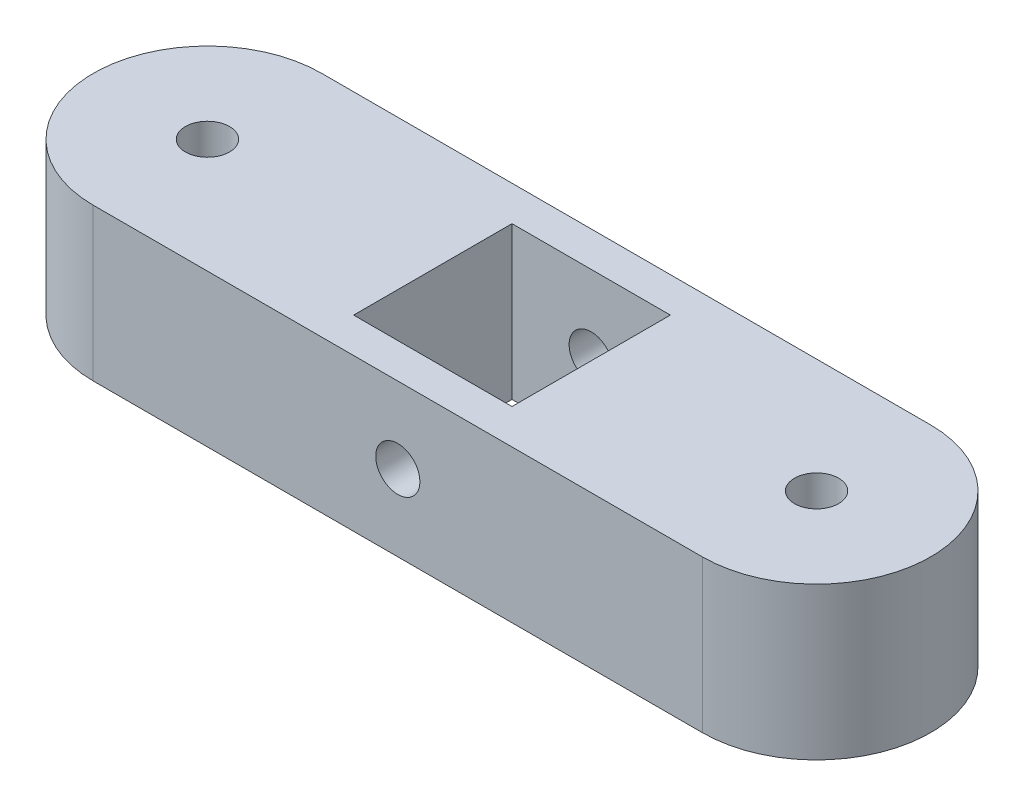
ISO-10303-21;
HEADER;
FILE_DESCRIPTION(('STEP AP214'),'2;1');
FILE_NAME('part.step','',(''),(''),'','','');
FILE_SCHEMA(('AUTOMOTIVE_DESIGN { 1 0 10303 214 1 1 1 1 }'));
ENDSEC;
DATA;
#1=APPLICATION_CONTEXT('core data for automotive mechanical design processes');
#2=APPLICATION_PROTOCOL_DEFINITION('international standard','automotive_design',2000,#1);
#3=PRODUCT_CONTEXT('',#1,'mechanical');
#4=PRODUCT('Part','Part','',(#3));
#5=PRODUCT_RELATED_PRODUCT_CATEGORY('part','',(#4));
#6=PRODUCT_DEFINITION_FORMATION('','',#4);
#7=PRODUCT_DEFINITION_CONTEXT('part definition',#1,'design');
#8=PRODUCT_DEFINITION('design','',#6,#7);
#9=PRODUCT_DEFINITION_SHAPE('','',#8);
#10=(LENGTH_UNIT() NAMED_UNIT(*) SI_UNIT(.MILLI.,.METRE.));
#11=(NAMED_UNIT(*) PLANE_ANGLE_UNIT() SI_UNIT($,.RADIAN.));
#12=(NAMED_UNIT(*) SI_UNIT($,.STERADIAN.) SOLID_ANGLE_UNIT());
#13=UNCERTAINTY_MEASURE_WITH_UNIT(LENGTH_MEASURE(1.E-05),#10,'distance_accuracy_value','');
#14=(GEOMETRIC_REPRESENTATION_CONTEXT(3) GLOBAL_UNCERTAINTY_ASSIGNED_CONTEXT((#13)) GLOBAL_UNIT_ASSIGNED_CONTEXT((#10,
#11,#12)) REPRESENTATION_CONTEXT('',''));
#15=CARTESIAN_POINT('',(0.,0.,0.));
#16=DIRECTION('',(0.,0.,1.));
#17=DIRECTION('',(1.,0.,0.));
#18=AXIS2_PLACEMENT_3D('',#15,#16,#17);
#19=CARTESIAN_POINT('',(-50.8,25.4,0.));
#20=DIRECTION('',(0.,1.,0.));
#21=DIRECTION('',(0.,0.,1.));
#22=AXIS2_PLACEMENT_3D('',#19,#20,#21);
#23=PLANE('',#22);
#24=DIRECTION('',(0.,0.,1.));
#25=VECTOR('',#24,1.);
#26=CARTESIAN_POINT('',(-13.208,25.4,-13.208));
#27=LINE('',#26,#25);
#28=CARTESIAN_POINT('',(-13.208,25.4,-13.208));
#29=VERTEX_POINT('',#28);
#30=CARTESIAN_POINT('',(-13.208,25.4,13.208));
#31=VERTEX_POINT('',#30);
#32=EDGE_CURVE('E107',#29,#31,#27,.T.);
#33=ORIENTED_EDGE('',*,*,#32,.F.);
#34=DIRECTION('',(-1.,0.,0.));
#35=VECTOR('',#34,1.);
#36=CARTESIAN_POINT('',(-13.208,25.4,-13.208));
#37=LINE('',#36,#35);
#38=CARTESIAN_POINT('',(13.208,25.4,-13.208));
#39=VERTEX_POINT('',#38);
#40=EDGE_CURVE('E99',#39,#29,#37,.T.);
#41=ORIENTED_EDGE('',*,*,#40,.F.);
#42=DIRECTION('',(0.,0.,-1.));
#43=VECTOR('',#42,1.);
#44=CARTESIAN_POINT('',(13.208,25.4,-13.208));
#45=LINE('',#44,#43);
#46=CARTESIAN_POINT('',(13.208,25.4,13.208));
#47=VERTEX_POINT('',#46);
#48=EDGE_CURVE('E122',#47,#39,#45,.T.);
#49=ORIENTED_EDGE('',*,*,#48,.F.);
#50=DIRECTION('',(1.,0.,0.));
#51=VECTOR('',#50,1.);
#52=CARTESIAN_POINT('',(-13.208,25.4,13.208));
#53=LINE('',#52,#51);
#54=EDGE_CURVE('E120',#31,#47,#53,.T.);
#55=ORIENTED_EDGE('',*,*,#54,.F.);
#56=EDGE_LOOP('',(#33,#41,#49,#55));
#57=FACE_BOUND('',#56,.T.);
#58=CARTESIAN_POINT('',(-50.8,25.4,0.));
#59=DIRECTION('',(0.,1.,0.));
#60=DIRECTION('',(0.,0.,1.));
#61=AXIS2_PLACEMENT_3D('',#58,#59,#60);
#62=CIRCLE('',#61,3.683);
#63=CARTESIAN_POINT('',(-50.8,25.4,3.683));
#64=VERTEX_POINT('',#63);
#65=EDGE_CURVE('E138',#64,#64,#62,.T.);
#66=ORIENTED_EDGE('',*,*,#65,.F.);
#67=EDGE_LOOP('',(#66));
#68=FACE_BOUND('',#67,.T.);
#69=CARTESIAN_POINT('',(-50.8,25.4,0.));
#70=DIRECTION('',(0.,1.,0.));
#71=DIRECTION('',(0.,0.,1.));
#72=AXIS2_PLACEMENT_3D('',#69,#70,#71);
#73=CIRCLE('',#72,19.05);
#74=CARTESIAN_POINT('',(-50.8,25.4,-19.05));
#75=VERTEX_POINT('',#74);
#76=CARTESIAN_POINT('',(-50.8,25.4,19.05));
#77=VERTEX_POINT('',#76);
#78=EDGE_CURVE('E144',#75,#77,#73,.T.);
#79=ORIENTED_EDGE('',*,*,#78,.T.);
#80=DIRECTION('',(1.,0.,0.));
#81=VECTOR('',#80,1.);
#82=CARTESIAN_POINT('',(-50.8,25.4,19.05));
#83=LINE('',#82,#81);
#84=CARTESIAN_POINT('',(50.8,25.4,19.05));
#85=VERTEX_POINT('',#84);
#86=EDGE_CURVE('E147',#77,#85,#83,.T.);
#87=ORIENTED_EDGE('',*,*,#86,.T.);
#88=CARTESIAN_POINT('',(50.8,25.4,0.));
#89=DIRECTION('',(0.,1.,0.));
#90=DIRECTION('',(0.,0.,1.));
#91=AXIS2_PLACEMENT_3D('',#88,#89,#90);
#92=CIRCLE('',#91,19.05);
#93=CARTESIAN_POINT('',(50.8,25.4,-19.05));
#94=VERTEX_POINT('',#93);
#95=EDGE_CURVE('E150',#85,#94,#92,.T.);
#96=ORIENTED_EDGE('',*,*,#95,.T.);
#97=DIRECTION('',(-1.,0.,0.));
#98=VECTOR('',#97,1.);
#99=CARTESIAN_POINT('',(-50.8,25.4,-19.05));
#100=LINE('',#99,#98);
#101=EDGE_CURVE('E152',#94,#75,#100,.T.);
#102=ORIENTED_EDGE('',*,*,#101,.T.);
#103=EDGE_LOOP('',(#79,#87,#96,#102));
#104=FACE_BOUND('',#103,.T.);
#105=CARTESIAN_POINT('',(50.8,25.4,0.));
#106=DIRECTION('',(0.,1.,0.));
#107=DIRECTION('',(0.,0.,-1.));
#108=AXIS2_PLACEMENT_3D('',#105,#106,#107);
#109=CIRCLE('',#108,3.683);
#110=CARTESIAN_POINT('',(50.8,25.4,-3.683));
#111=VERTEX_POINT('',#110);
#112=EDGE_CURVE('E128',#111,#111,#109,.T.);
#113=ORIENTED_EDGE('',*,*,#112,.F.);
#114=EDGE_LOOP('',(#113));
#115=FACE_BOUND('',#114,.T.);
#116=ADVANCED_FACE('F33',(#57,#68,#104,#115),#23,.T.);
#117=CARTESIAN_POINT('',(-50.8,0.,0.));
#118=DIRECTION('',(0.,1.,0.));
#119=DIRECTION('',(0.,0.,1.));
#120=AXIS2_PLACEMENT_3D('',#117,#118,#119);
#121=PLANE('',#120);
#122=CARTESIAN_POINT('',(-50.8,0.,0.));
#123=DIRECTION('',(0.,1.,0.));
#124=DIRECTION('',(0.,0.,1.));
#125=AXIS2_PLACEMENT_3D('',#122,#123,#124);
#126=CIRCLE('',#125,3.683);
#127=CARTESIAN_POINT('',(-50.8,0.,3.683));
#128=VERTEX_POINT('',#127);
#129=EDGE_CURVE('E115',#128,#128,#126,.T.);
#130=ORIENTED_EDGE('',*,*,#129,.T.);
#131=EDGE_LOOP('',(#130));
#132=FACE_BOUND('',#131,.T.);
#133=CARTESIAN_POINT('',(-50.8,0.,0.));
#134=DIRECTION('',(0.,1.,0.));
#135=DIRECTION('',(0.,0.,1.));
#136=AXIS2_PLACEMENT_3D('',#133,#134,#135);
#137=CIRCLE('',#136,19.05);
#138=CARTESIAN_POINT('',(-50.8,0.,-19.05));
#139=VERTEX_POINT('',#138);
#140=CARTESIAN_POINT('',(-50.8,0.,19.05));
#141=VERTEX_POINT('',#140);
#142=EDGE_CURVE('E141',#139,#141,#137,.T.);
#143=ORIENTED_EDGE('',*,*,#142,.F.);
#144=DIRECTION('',(-1.,0.,0.));
#145=VECTOR('',#144,1.);
#146=CARTESIAN_POINT('',(-50.8,0.,-19.05));
#147=LINE('',#146,#145);
#148=CARTESIAN_POINT('',(50.8,0.,-19.05));
#149=VERTEX_POINT('',#148);
#150=EDGE_CURVE('E148',#149,#139,#147,.T.);
#151=ORIENTED_EDGE('',*,*,#150,.F.);
#152=CARTESIAN_POINT('',(50.8,0.,0.));
#153=DIRECTION('',(0.,1.,0.));
#154=DIRECTION('',(0.,0.,1.));
#155=AXIS2_PLACEMENT_3D('',#152,#153,#154);
#156=CIRCLE('',#155,19.05);
#157=CARTESIAN_POINT('',(50.8,0.,19.05));
#158=VERTEX_POINT('',#157);
#159=EDGE_CURVE('E159',#158,#149,#156,.T.);
#160=ORIENTED_EDGE('',*,*,#159,.F.);
#161=DIRECTION('',(1.,0.,0.));
#162=VECTOR('',#161,1.);
#163=CARTESIAN_POINT('',(-50.8,0.,19.05));
#164=LINE('',#163,#162);
#165=EDGE_CURVE('E157',#141,#158,#164,.T.);
#166=ORIENTED_EDGE('',*,*,#165,.F.);
#167=EDGE_LOOP('',(#143,#151,#160,#166));
#168=FACE_BOUND('',#167,.T.);
#169=DIRECTION('',(-1.,0.,0.));
#170=VECTOR('',#169,1.);
#171=CARTESIAN_POINT('',(-13.208,0.,-13.208));
#172=LINE('',#171,#170);
#173=CARTESIAN_POINT('',(13.208,0.,-13.208));
#174=VERTEX_POINT('',#173);
#175=CARTESIAN_POINT('',(-13.208,0.,-13.208));
#176=VERTEX_POINT('',#175);
#177=EDGE_CURVE('E57',#174,#176,#172,.T.);
#178=ORIENTED_EDGE('',*,*,#177,.T.);
#179=DIRECTION('',(0.,0.,1.));
#180=VECTOR('',#179,1.);
#181=CARTESIAN_POINT('',(-13.208,0.,-13.208));
#182=LINE('',#181,#180);
#183=CARTESIAN_POINT('',(-13.208,0.,13.208));
#184=VERTEX_POINT('',#183);
#185=EDGE_CURVE('E114',#176,#184,#182,.T.);
#186=ORIENTED_EDGE('',*,*,#185,.T.);
#187=DIRECTION('',(1.,0.,0.));
#188=VECTOR('',#187,1.);
#189=CARTESIAN_POINT('',(-13.208,0.,13.208));
#190=LINE('',#189,#188);
#191=CARTESIAN_POINT('',(13.208,0.,13.208));
#192=VERTEX_POINT('',#191);
#193=EDGE_CURVE('E130',#184,#192,#190,.T.);
#194=ORIENTED_EDGE('',*,*,#193,.T.);
#195=DIRECTION('',(0.,0.,-1.));
#196=VECTOR('',#195,1.);
#197=CARTESIAN_POINT('',(13.208,0.,-13.208));
#198=LINE('',#197,#196);
#199=EDGE_CURVE('E108',#192,#174,#198,.T.);
#200=ORIENTED_EDGE('',*,*,#199,.T.);
#201=EDGE_LOOP('',(#178,#186,#194,#200));
#202=FACE_BOUND('',#201,.T.);
#203=CARTESIAN_POINT('',(50.8,0.,0.));
#204=DIRECTION('',(0.,1.,0.));
#205=DIRECTION('',(0.,0.,-1.));
#206=AXIS2_PLACEMENT_3D('',#203,#204,#205);
#207=CIRCLE('',#206,3.683);
#208=CARTESIAN_POINT('',(50.8,0.,-3.683));
#209=VERTEX_POINT('',#208);
#210=EDGE_CURVE('E228',#209,#209,#207,.T.);
#211=ORIENTED_EDGE('',*,*,#210,.T.);
#212=EDGE_LOOP('',(#211));
#213=FACE_BOUND('',#212,.T.);
#214=ADVANCED_FACE('F178',(#132,#168,#202,#213),#121,.F.);
#215=CARTESIAN_POINT('',(-50.8,25.4,0.));
#216=DIRECTION('',(0.,-1.,0.));
#217=DIRECTION('',(0.,0.,-1.));
#218=AXIS2_PLACEMENT_3D('',#215,#216,#217);
#219=CYLINDRICAL_SURFACE('',#218,19.05);
#220=ORIENTED_EDGE('',*,*,#142,.T.);
#221=DIRECTION('',(0.,-1.,0.));
#222=VECTOR('',#221,1.);
#223=CARTESIAN_POINT('',(-50.8,25.4,19.05));
#224=LINE('',#223,#222);
#225=EDGE_CURVE('E11',#77,#141,#224,.T.);
#226=ORIENTED_EDGE('',*,*,#225,.F.);
#227=ORIENTED_EDGE('',*,*,#78,.F.);
#228=DIRECTION('',(0.,-1.,0.));
#229=VECTOR('',#228,1.);
#230=CARTESIAN_POINT('',(-50.8,25.4,-19.05));
#231=LINE('',#230,#229);
#232=EDGE_CURVE('E154',#75,#139,#231,.T.);
#233=ORIENTED_EDGE('',*,*,#232,.T.);
#234=EDGE_LOOP('',(#220,#226,#227,#233));
#235=FACE_BOUND('',#234,.T.);
#236=ADVANCED_FACE('F35',(#235),#219,.T.);
#237=CARTESIAN_POINT('',(-50.8,25.4,19.05));
#238=DIRECTION('',(0.,0.,-1.));
#239=DIRECTION('',(-1.,0.,0.));
#240=AXIS2_PLACEMENT_3D('',#237,#238,#239);
#241=PLANE('',#240);
#242=CARTESIAN_POINT('',(0.,12.7,19.05));
#243=DIRECTION('',(0.,0.,1.));
#244=DIRECTION('',(1.,0.,0.));
#245=AXIS2_PLACEMENT_3D('',#242,#243,#244);
#246=CIRCLE('',#245,3.683);
#247=CARTESIAN_POINT('',(3.68300000000001,12.7,19.05));
#248=VERTEX_POINT('',#247);
#249=EDGE_CURVE('E219',#248,#248,#246,.T.);
#250=ORIENTED_EDGE('',*,*,#249,.F.);
#251=EDGE_LOOP('',(#250));
#252=FACE_BOUND('',#251,.T.);
#253=ORIENTED_EDGE('',*,*,#165,.T.);
#254=DIRECTION('',(0.,-1.,0.));
#255=VECTOR('',#254,1.);
#256=CARTESIAN_POINT('',(50.8,25.4,19.05));
#257=LINE('',#256,#255);
#258=EDGE_CURVE('E42',#85,#158,#257,.T.);
#259=ORIENTED_EDGE('',*,*,#258,.F.);
#260=ORIENTED_EDGE('',*,*,#86,.F.);
#261=ORIENTED_EDGE('',*,*,#225,.T.);
#262=EDGE_LOOP('',(#253,#259,#260,#261));
#263=FACE_BOUND('',#262,.T.);
#264=ADVANCED_FACE('F189',(#252,#263),#241,.F.);
#265=CARTESIAN_POINT('',(50.8,25.4,0.));
#266=DIRECTION('',(0.,-1.,0.));
#267=DIRECTION('',(0.,0.,-1.));
#268=AXIS2_PLACEMENT_3D('',#265,#266,#267);
#269=CYLINDRICAL_SURFACE('',#268,19.05);
#270=ORIENTED_EDGE('',*,*,#159,.T.);
#271=DIRECTION('',(0.,-1.,0.));
#272=VECTOR('',#271,1.);
#273=CARTESIAN_POINT('',(50.8,25.4,-19.05));
#274=LINE('',#273,#272);
#275=EDGE_CURVE('E164',#94,#149,#274,.T.);
#276=ORIENTED_EDGE('',*,*,#275,.F.);
#277=ORIENTED_EDGE('',*,*,#95,.F.);
#278=ORIENTED_EDGE('',*,*,#258,.T.);
#279=EDGE_LOOP('',(#270,#276,#277,#278));
#280=FACE_BOUND('',#279,.T.);
#281=ADVANCED_FACE('F172',(#280),#269,.T.);
#282=CARTESIAN_POINT('',(-50.8,25.4,-19.05));
#283=DIRECTION('',(0.,0.,1.));
#284=DIRECTION('',(1.,0.,0.));
#285=AXIS2_PLACEMENT_3D('',#282,#283,#284);
#286=PLANE('',#285);
#287=CARTESIAN_POINT('',(0.,12.7,-19.05));
#288=DIRECTION('',(0.,0.,1.));
#289=DIRECTION('',(1.,0.,0.));
#290=AXIS2_PLACEMENT_3D('',#287,#288,#289);
#291=CIRCLE('',#290,3.683);
#292=CARTESIAN_POINT('',(3.68300000000001,12.7,-19.05));
#293=VERTEX_POINT('',#292);
#294=EDGE_CURVE('E217',#293,#293,#291,.T.);
#295=ORIENTED_EDGE('',*,*,#294,.T.);
#296=EDGE_LOOP('',(#295));
#297=FACE_BOUND('',#296,.T.);
#298=ORIENTED_EDGE('',*,*,#150,.T.);
#299=ORIENTED_EDGE('',*,*,#232,.F.);
#300=ORIENTED_EDGE('',*,*,#101,.F.);
#301=ORIENTED_EDGE('',*,*,#275,.T.);
#302=EDGE_LOOP('',(#298,#299,#300,#301));
#303=FACE_BOUND('',#302,.T.);
#304=ADVANCED_FACE('F182',(#297,#303),#286,.F.);
#305=CARTESIAN_POINT('',(-50.8,25.4,0.));
#306=DIRECTION('',(0.,-1.,0.));
#307=DIRECTION('',(0.,0.,-1.));
#308=AXIS2_PLACEMENT_3D('',#305,#306,#307);
#309=CYLINDRICAL_SURFACE('',#308,3.683);
#310=ORIENTED_EDGE('',*,*,#65,.T.);
#311=EDGE_LOOP('',(#310));
#312=FACE_BOUND('',#311,.T.);
#313=ORIENTED_EDGE('',*,*,#129,.F.);
#314=EDGE_LOOP('',(#313));
#315=FACE_BOUND('',#314,.T.);
#316=ADVANCED_FACE('F206',(#312,#315),#309,.F.);
#317=CARTESIAN_POINT('',(-13.208,25.4,-13.208));
#318=DIRECTION('',(0.,0.,1.));
#319=DIRECTION('',(1.,0.,0.));
#320=AXIS2_PLACEMENT_3D('',#317,#318,#319);
#321=PLANE('',#320);
#322=CARTESIAN_POINT('',(0.,12.7,-13.208));
#323=DIRECTION('',(0.,0.,1.));
#324=DIRECTION('',(1.,0.,0.));
#325=AXIS2_PLACEMENT_3D('',#322,#323,#324);
#326=CIRCLE('',#325,3.683);
#327=CARTESIAN_POINT('',(3.68300000000001,12.7,-13.208));
#328=VERTEX_POINT('',#327);
#329=EDGE_CURVE('E222',#328,#328,#326,.T.);
#330=ORIENTED_EDGE('',*,*,#329,.F.);
#331=EDGE_LOOP('',(#330));
#332=FACE_BOUND('',#331,.T.);
#333=ORIENTED_EDGE('',*,*,#177,.F.);
#334=DIRECTION('',(0.,-1.,0.));
#335=VECTOR('',#334,1.);
#336=CARTESIAN_POINT('',(13.208,25.4,-13.208));
#337=LINE('',#336,#335);
#338=EDGE_CURVE('E103',#39,#174,#337,.T.);
#339=ORIENTED_EDGE('',*,*,#338,.F.);
#340=ORIENTED_EDGE('',*,*,#40,.T.);
#341=DIRECTION('',(0.,-1.,0.));
#342=VECTOR('',#341,1.);
#343=CARTESIAN_POINT('',(-13.208,25.4,-13.208));
#344=LINE('',#343,#342);
#345=EDGE_CURVE('E102',#29,#176,#344,.T.);
#346=ORIENTED_EDGE('',*,*,#345,.T.);
#347=EDGE_LOOP('',(#333,#339,#340,#346));
#348=FACE_BOUND('',#347,.T.);
#349=ADVANCED_FACE('F101',(#332,#348),#321,.T.);
#350=CARTESIAN_POINT('',(-13.208,25.4,-13.208));
#351=DIRECTION('',(1.,0.,0.));
#352=DIRECTION('',(0.,0.,-1.));
#353=AXIS2_PLACEMENT_3D('',#350,#351,#352);
#354=PLANE('',#353);
#355=ORIENTED_EDGE('',*,*,#185,.F.);
#356=ORIENTED_EDGE('',*,*,#345,.F.);
#357=ORIENTED_EDGE('',*,*,#32,.T.);
#358=DIRECTION('',(0.,-1.,0.));
#359=VECTOR('',#358,1.);
#360=CARTESIAN_POINT('',(-13.208,25.4,13.208));
#361=LINE('',#360,#359);
#362=EDGE_CURVE('E116',#31,#184,#361,.T.);
#363=ORIENTED_EDGE('',*,*,#362,.T.);
#364=EDGE_LOOP('',(#355,#356,#357,#363));
#365=FACE_BOUND('',#364,.T.);
#366=ADVANCED_FACE('F111',(#365),#354,.T.);
#367=CARTESIAN_POINT('',(-13.208,25.4,13.208));
#368=DIRECTION('',(0.,0.,-1.));
#369=DIRECTION('',(-1.,0.,0.));
#370=AXIS2_PLACEMENT_3D('',#367,#368,#369);
#371=PLANE('',#370);
#372=CARTESIAN_POINT('',(0.,12.7,13.208));
#373=DIRECTION('',(0.,0.,-1.));
#374=DIRECTION('',(-1.,0.,0.));
#375=AXIS2_PLACEMENT_3D('',#372,#373,#374);
#376=CIRCLE('',#375,3.683);
#377=CARTESIAN_POINT('',(-3.68299999999999,12.7,13.208));
#378=VERTEX_POINT('',#377);
#379=EDGE_CURVE('E37',#378,#378,#376,.T.);
#380=ORIENTED_EDGE('',*,*,#379,.F.);
#381=EDGE_LOOP('',(#380));
#382=FACE_BOUND('',#381,.T.);
#383=ORIENTED_EDGE('',*,*,#193,.F.);
#384=ORIENTED_EDGE('',*,*,#362,.F.);
#385=ORIENTED_EDGE('',*,*,#54,.T.);
#386=DIRECTION('',(0.,-1.,0.));
#387=VECTOR('',#386,1.);
#388=CARTESIAN_POINT('',(13.208,25.4,13.208));
#389=LINE('',#388,#387);
#390=EDGE_CURVE('E49',#47,#192,#389,.T.);
#391=ORIENTED_EDGE('',*,*,#390,.T.);
#392=EDGE_LOOP('',(#383,#384,#385,#391));
#393=FACE_BOUND('',#392,.T.);
#394=ADVANCED_FACE('F247',(#382,#393),#371,.T.);
#395=CARTESIAN_POINT('',(13.208,25.4,-13.208));
#396=DIRECTION('',(-1.,0.,0.));
#397=DIRECTION('',(0.,0.,1.));
#398=AXIS2_PLACEMENT_3D('',#395,#396,#397);
#399=PLANE('',#398);
#400=ORIENTED_EDGE('',*,*,#199,.F.);
#401=ORIENTED_EDGE('',*,*,#390,.F.);
#402=ORIENTED_EDGE('',*,*,#48,.T.);
#403=ORIENTED_EDGE('',*,*,#338,.T.);
#404=EDGE_LOOP('',(#400,#401,#402,#403));
#405=FACE_BOUND('',#404,.T.);
#406=ADVANCED_FACE('F237',(#405),#399,.T.);
#407=CARTESIAN_POINT('',(50.8,25.4,0.));
#408=DIRECTION('',(0.,-1.,0.));
#409=DIRECTION('',(0.,0.,-1.));
#410=AXIS2_PLACEMENT_3D('',#407,#408,#409);
#411=CYLINDRICAL_SURFACE('',#410,3.683);
#412=ORIENTED_EDGE('',*,*,#112,.T.);
#413=EDGE_LOOP('',(#412));
#414=FACE_BOUND('',#413,.T.);
#415=ORIENTED_EDGE('',*,*,#210,.F.);
#416=EDGE_LOOP('',(#415));
#417=FACE_BOUND('',#416,.T.);
#418=ADVANCED_FACE('F234',(#414,#417),#411,.F.);
#419=CARTESIAN_POINT('',(0.,12.7,-19.05));
#420=DIRECTION('',(0.,0.,1.));
#421=DIRECTION('',(1.,0.,0.));
#422=AXIS2_PLACEMENT_3D('',#419,#420,#421);
#423=CYLINDRICAL_SURFACE('',#422,3.683);
#424=ORIENTED_EDGE('',*,*,#379,.T.);
#425=EDGE_LOOP('',(#424));
#426=FACE_BOUND('',#425,.T.);
#427=ORIENTED_EDGE('',*,*,#249,.T.);
#428=EDGE_LOOP('',(#427));
#429=FACE_BOUND('',#428,.T.);
#430=ADVANCED_FACE('F236',(#426,#429),#423,.F.);
#431=ORIENTED_EDGE('',*,*,#329,.T.);
#432=EDGE_LOOP('',(#431));
#433=FACE_BOUND('',#432,.T.);
#434=ORIENTED_EDGE('',*,*,#294,.F.);
#435=EDGE_LOOP('',(#434));
#436=FACE_BOUND('',#435,.T.);
#437=ADVANCED_FACE('F244',(#433,#436),#423,.F.);
#438=CLOSED_SHELL('',(#116,#214,#236,#264,#281,#304,#316,#349,#366,#394,#406,#418,#430,#437));
#439=MANIFOLD_SOLID_BREP('B2',#438);
#440=ADVANCED_BREP_SHAPE_REPRESENTATION('',(#18,#439),#14);
#441=SHAPE_DEFINITION_REPRESENTATION(#9,#440);
ENDSEC;
END-ISO-10303-21;
